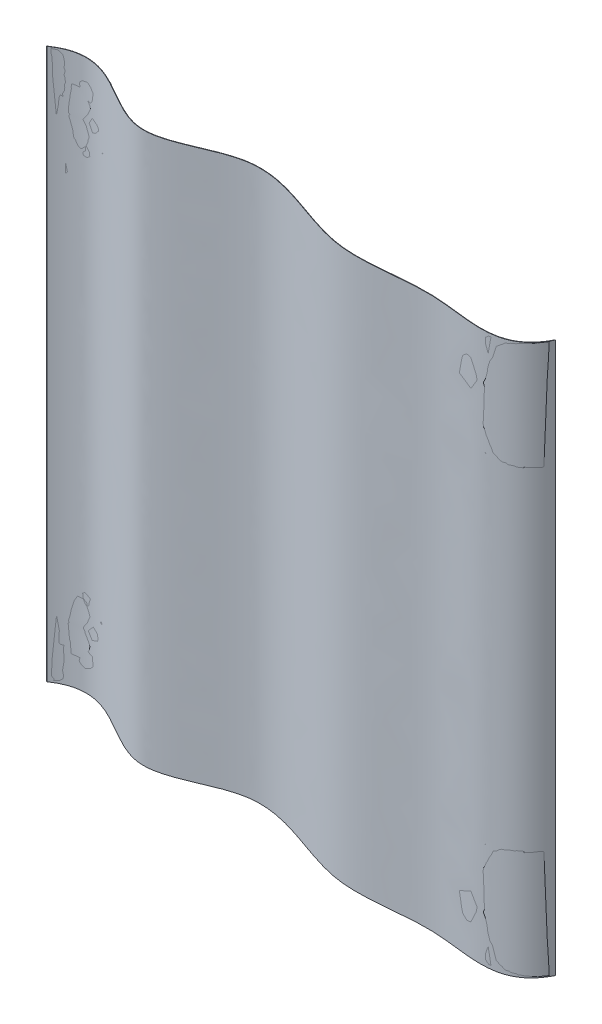
ISO-10303-21;
HEADER;
FILE_DESCRIPTION(('STEP AP214'),'2;1');
FILE_NAME('part.step','',(''),(''),'','','');
FILE_SCHEMA(('AUTOMOTIVE_DESIGN { 1 0 10303 214 1 1 1 1 }'));
ENDSEC;
DATA;
#1=APPLICATION_CONTEXT('core data for automotive mechanical design processes');
#2=APPLICATION_PROTOCOL_DEFINITION('international standard','automotive_design',2000,#1);
#3=PRODUCT_CONTEXT('',#1,'mechanical');
#4=PRODUCT('Part','Part','',(#3));
#5=PRODUCT_RELATED_PRODUCT_CATEGORY('part','',(#4));
#6=PRODUCT_DEFINITION_FORMATION('','',#4);
#7=PRODUCT_DEFINITION_CONTEXT('part definition',#1,'design');
#8=PRODUCT_DEFINITION('design','',#6,#7);
#9=PRODUCT_DEFINITION_SHAPE('','',#8);
#10=(LENGTH_UNIT() NAMED_UNIT(*) SI_UNIT(.MILLI.,.METRE.));
#11=(NAMED_UNIT(*) PLANE_ANGLE_UNIT() SI_UNIT($,.RADIAN.));
#12=(NAMED_UNIT(*) SI_UNIT($,.STERADIAN.) SOLID_ANGLE_UNIT());
#13=UNCERTAINTY_MEASURE_WITH_UNIT(LENGTH_MEASURE(1.E-05),#10,'distance_accuracy_value','');
#14=(GEOMETRIC_REPRESENTATION_CONTEXT(3) GLOBAL_UNCERTAINTY_ASSIGNED_CONTEXT((#13)) GLOBAL_UNIT_ASSIGNED_CONTEXT((#10,
#11,#12)) REPRESENTATION_CONTEXT('',''));
#15=CARTESIAN_POINT('',(0.,0.,0.));
#16=DIRECTION('',(0.,0.,1.));
#17=DIRECTION('',(1.,0.,0.));
#18=AXIS2_PLACEMENT_3D('',#15,#16,#17);
#19=CARTESIAN_POINT('',(0.,680.,0.));
#20=CARTESIAN_POINT('',(55.4505286891141,680.,-39.3655602056034));
#21=CARTESIAN_POINT('',(128.130899193224,680.,70.3889883734091));
#22=CARTESIAN_POINT('',(260.772645788461,680.,-32.2645963970792));
#23=CARTESIAN_POINT('',(382.260136785364,680.,50.5233728252896));
#24=CARTESIAN_POINT('',(511.559750238836,680.,14.5896087260463));
#25=CARTESIAN_POINT('',(604.179755225305,680.,48.7202248083096));
#26=CARTESIAN_POINT('',(628.67,680.,0.));
#27=B_SPLINE_CURVE_WITH_KNOTS('',3,(#19,#20,#21,#22,#23,#24,#25,#26),.UNSPECIFIED.,.F.,.F.,(4,1,
1,1,1,4),(0.,0.230470428606005,0.39356628910068,0.620872555379836,0.80123818697734,1.),.UNSPECIFIED.);
#28=DIRECTION('',(0.,-1.,0.));
#29=VECTOR('',#28,1.);
#30=SURFACE_OF_LINEAR_EXTRUSION('',#27,#29);
#31=CARTESIAN_POINT('',(0.,0.,0.));
#32=CARTESIAN_POINT('',(55.4505286891141,0.,-39.3655602056034));
#33=CARTESIAN_POINT('',(128.130899193224,0.,70.3889883734091));
#34=CARTESIAN_POINT('',(260.772645788461,0.,-32.2645963970792));
#35=CARTESIAN_POINT('',(382.260136785364,0.,50.5233728252896));
#36=CARTESIAN_POINT('',(511.559750238836,0.,14.5896087260463));
#37=CARTESIAN_POINT('',(604.179755225305,0.,48.7202248083096));
#38=CARTESIAN_POINT('',(628.67,0.,0.));
#39=B_SPLINE_CURVE_WITH_KNOTS('',3,(#31,#32,#33,#34,#35,#36,#37,#38),.UNSPECIFIED.,.F.,.F.,(4,1,
1,1,1,4),(0.,0.230470428606005,0.39356628910068,0.620872555379836,0.80123818697734,1.),.UNSPECIFIED.);
#40=CARTESIAN_POINT('',(0.,0.,0.));
#41=VERTEX_POINT('',#40);
#42=CARTESIAN_POINT('',(628.67,0.,0.));
#43=VERTEX_POINT('',#42);
#44=EDGE_CURVE('E133',#41,#43,#39,.T.);
#45=ORIENTED_EDGE('',*,*,#44,.F.);
#46=DIRECTION('',(0.,-1.,0.));
#47=VECTOR('',#46,1.);
#48=CARTESIAN_POINT('',(0.,680.,0.));
#49=LINE('',#48,#47);
#50=CARTESIAN_POINT('',(0.,680.,0.));
#51=VERTEX_POINT('',#50);
#52=EDGE_CURVE('E11',#51,#41,#49,.T.);
#53=ORIENTED_EDGE('',*,*,#52,.F.);
#54=CARTESIAN_POINT('',(628.67,680.,0.));
#55=VERTEX_POINT('',#54);
#56=EDGE_CURVE('E97',#51,#55,#27,.T.);
#57=ORIENTED_EDGE('',*,*,#56,.T.);
#58=DIRECTION('',(0.,-1.,0.));
#59=VECTOR('',#58,1.);
#60=CARTESIAN_POINT('',(628.67,680.,0.));
#61=LINE('',#60,#59);
#62=EDGE_CURVE('E65',#55,#43,#61,.T.);
#63=ORIENTED_EDGE('',*,*,#62,.T.);
#64=EDGE_LOOP('',(#45,#53,#57,#63));
#65=FACE_BOUND('',#64,.T.);
#66=ADVANCED_FACE('F47',(#65),#30,.T.);
#67=CARTESIAN_POINT('',(0.,680.,0.));
#68=DIRECTION('',(0.,0.,-1.));
#69=DIRECTION('',(-1.,0.,0.));
#70=AXIS2_PLACEMENT_3D('',#67,#68,#69);
#71=PLANE('',#70);
#72=DIRECTION('',(1.,0.,0.));
#73=VECTOR('',#72,1.);
#74=CARTESIAN_POINT('',(0.,0.,0.));
#75=LINE('',#74,#73);
#76=CARTESIAN_POINT('',(0.5,0.,0.));
#77=VERTEX_POINT('',#76);
#78=EDGE_CURVE('E104',#41,#77,#75,.T.);
#79=ORIENTED_EDGE('',*,*,#78,.T.);
#80=DIRECTION('',(0.,-1.,0.));
#81=VECTOR('',#80,1.);
#82=CARTESIAN_POINT('',(0.5,680.,0.));
#83=LINE('',#82,#81);
#84=CARTESIAN_POINT('',(0.5,680.,0.));
#85=VERTEX_POINT('',#84);
#86=EDGE_CURVE('E57',#85,#77,#83,.T.);
#87=ORIENTED_EDGE('',*,*,#86,.F.);
#88=DIRECTION('',(1.,0.,0.));
#89=VECTOR('',#88,1.);
#90=CARTESIAN_POINT('',(0.,680.,0.));
#91=LINE('',#90,#89);
#92=EDGE_CURVE('E91',#51,#85,#91,.T.);
#93=ORIENTED_EDGE('',*,*,#92,.F.);
#94=ORIENTED_EDGE('',*,*,#52,.T.);
#95=EDGE_LOOP('',(#79,#87,#93,#94));
#96=FACE_BOUND('',#95,.T.);
#97=ADVANCED_FACE('F102',(#96),#71,.F.);
#98=CARTESIAN_POINT('',(0.5,680.,0.));
#99=CARTESIAN_POINT('',(55.7472119917208,680.,-38.4100383060232));
#100=CARTESIAN_POINT('',(128.289677241472,680.,70.7512819800582));
#101=CARTESIAN_POINT('',(260.77583230256,680.,-31.7564605374319));
#102=CARTESIAN_POINT('',(382.251191848017,680.,50.9975458131628));
#103=CARTESIAN_POINT('',(511.815853222403,680.,15.1008171110627));
#104=CARTESIAN_POINT('',(604.645450821186,680.,49.233792530373));
#105=CARTESIAN_POINT('',(629.17,680.,0.));
#106=B_SPLINE_CURVE_WITH_KNOTS('',3,(#98,#99,#100,#101,#102,#103,#104,#105),.UNSPECIFIED.,.F.,
.F.,(4,1,1,1,1,4),(0.,0.229631966153182,0.392676675480709,0.619911652514478,0.800220716688739,
1.),.UNSPECIFIED.);
#107=DIRECTION('',(0.,-1.,0.));
#108=VECTOR('',#107,1.);
#109=SURFACE_OF_LINEAR_EXTRUSION('',#106,#108);
#110=CARTESIAN_POINT('',(0.5,0.,0.));
#111=CARTESIAN_POINT('',(55.7472119917208,0.,-38.4100383060232));
#112=CARTESIAN_POINT('',(128.289677241472,0.,70.7512819800582));
#113=CARTESIAN_POINT('',(260.77583230256,0.,-31.7564605374319));
#114=CARTESIAN_POINT('',(382.251191848017,0.,50.9975458131628));
#115=CARTESIAN_POINT('',(511.815853222403,0.,15.1008171110627));
#116=CARTESIAN_POINT('',(604.645450821186,0.,49.233792530373));
#117=CARTESIAN_POINT('',(629.17,0.,0.));
#118=B_SPLINE_CURVE_WITH_KNOTS('',3,(#110,#111,#112,#113,#114,#115,#116,#117),.UNSPECIFIED.,.F.,
.F.,(4,1,1,1,1,4),(0.,0.229631966153182,0.392676675480709,0.619911652514478,0.800220716688739,
1.),.UNSPECIFIED.);
#119=CARTESIAN_POINT('',(629.17,0.,0.));
#120=VERTEX_POINT('',#119);
#121=EDGE_CURVE('E138',#77,#120,#118,.T.);
#122=ORIENTED_EDGE('',*,*,#121,.T.);
#123=DIRECTION('',(0.,-1.,0.));
#124=VECTOR('',#123,1.);
#125=CARTESIAN_POINT('',(629.17,680.,0.));
#126=LINE('',#125,#124);
#127=CARTESIAN_POINT('',(629.17,680.,0.));
#128=VERTEX_POINT('',#127);
#129=EDGE_CURVE('E79',#128,#120,#126,.T.);
#130=ORIENTED_EDGE('',*,*,#129,.F.);
#131=EDGE_CURVE('E96',#85,#128,#106,.T.);
#132=ORIENTED_EDGE('',*,*,#131,.F.);
#133=ORIENTED_EDGE('',*,*,#86,.T.);
#134=EDGE_LOOP('',(#122,#130,#132,#133));
#135=FACE_BOUND('',#134,.T.);
#136=ADVANCED_FACE('F108',(#135),#109,.F.);
#137=CARTESIAN_POINT('',(0.,680.,0.));
#138=DIRECTION('',(0.,0.,-1.));
#139=DIRECTION('',(-1.,0.,0.));
#140=AXIS2_PLACEMENT_3D('',#137,#138,#139);
#141=PLANE('',#140);
#142=DIRECTION('',(1.,0.,0.));
#143=VECTOR('',#142,1.);
#144=CARTESIAN_POINT('',(0.,0.,0.));
#145=LINE('',#144,#143);
#146=EDGE_CURVE('E150',#43,#120,#145,.T.);
#147=ORIENTED_EDGE('',*,*,#146,.F.);
#148=ORIENTED_EDGE('',*,*,#62,.F.);
#149=DIRECTION('',(1.,0.,0.));
#150=VECTOR('',#149,1.);
#151=CARTESIAN_POINT('',(0.,680.,0.));
#152=LINE('',#151,#150);
#153=EDGE_CURVE('E110',#55,#128,#152,.T.);
#154=ORIENTED_EDGE('',*,*,#153,.T.);
#155=ORIENTED_EDGE('',*,*,#129,.T.);
#156=EDGE_LOOP('',(#147,#148,#154,#155));
#157=FACE_BOUND('',#156,.T.);
#158=ADVANCED_FACE('F125',(#157),#141,.T.);
#159=CARTESIAN_POINT('',(0.,680.,0.));
#160=DIRECTION('',(0.,1.,0.));
#161=DIRECTION('',(0.,0.,1.));
#162=AXIS2_PLACEMENT_3D('',#159,#160,#161);
#163=PLANE('',#162);
#164=ORIENTED_EDGE('',*,*,#56,.F.);
#165=ORIENTED_EDGE('',*,*,#92,.T.);
#166=ORIENTED_EDGE('',*,*,#131,.T.);
#167=ORIENTED_EDGE('',*,*,#153,.F.);
#168=EDGE_LOOP('',(#164,#165,#166,#167));
#169=FACE_BOUND('',#168,.T.);
#170=ADVANCED_FACE('F93',(#169),#163,.T.);
#171=CARTESIAN_POINT('',(0.,0.,0.));
#172=DIRECTION('',(0.,1.,0.));
#173=DIRECTION('',(0.,0.,1.));
#174=AXIS2_PLACEMENT_3D('',#171,#172,#173);
#175=PLANE('',#174);
#176=ORIENTED_EDGE('',*,*,#44,.T.);
#177=ORIENTED_EDGE('',*,*,#146,.T.);
#178=ORIENTED_EDGE('',*,*,#121,.F.);
#179=ORIENTED_EDGE('',*,*,#78,.F.);
#180=EDGE_LOOP('',(#176,#177,#178,#179));
#181=FACE_BOUND('',#180,.T.);
#182=ADVANCED_FACE('F169',(#181),#175,.F.);
#183=CLOSED_SHELL('',(#66,#97,#136,#158,#170,#182));
#184=MANIFOLD_SOLID_BREP('B2',#183);
#185=ADVANCED_BREP_SHAPE_REPRESENTATION('',(#18,#184),#14);
#186=SHAPE_DEFINITION_REPRESENTATION(#9,#185);
ENDSEC;
END-ISO-10303-21;
